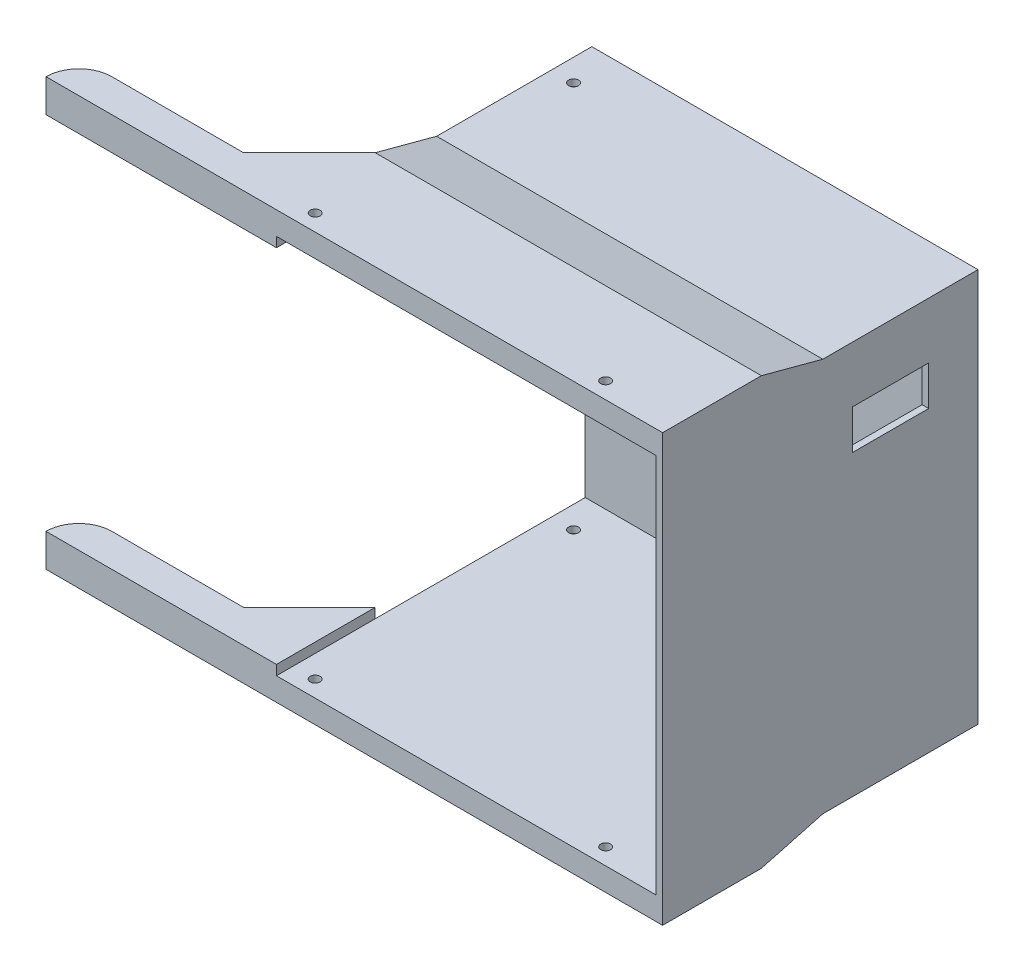
ISO-10303-21;
HEADER;
FILE_DESCRIPTION(('STEP AP214'),'2;1');
FILE_NAME('part.step','',(''),(''),'','','');
FILE_SCHEMA(('AUTOMOTIVE_DESIGN { 1 0 10303 214 1 1 1 1 }'));
ENDSEC;
DATA;
#1=APPLICATION_CONTEXT('core data for automotive mechanical design processes');
#2=APPLICATION_PROTOCOL_DEFINITION('international standard','automotive_design',2000,#1);
#3=PRODUCT_CONTEXT('',#1,'mechanical');
#4=PRODUCT('Part','Part','',(#3));
#5=PRODUCT_RELATED_PRODUCT_CATEGORY('part','',(#4));
#6=PRODUCT_DEFINITION_FORMATION('','',#4);
#7=PRODUCT_DEFINITION_CONTEXT('part definition',#1,'design');
#8=PRODUCT_DEFINITION('design','',#6,#7);
#9=PRODUCT_DEFINITION_SHAPE('','',#8);
#10=(LENGTH_UNIT() NAMED_UNIT(*) SI_UNIT(.MILLI.,.METRE.));
#11=(NAMED_UNIT(*) PLANE_ANGLE_UNIT() SI_UNIT($,.RADIAN.));
#12=(NAMED_UNIT(*) SI_UNIT($,.STERADIAN.) SOLID_ANGLE_UNIT());
#13=UNCERTAINTY_MEASURE_WITH_UNIT(LENGTH_MEASURE(1.E-05),#10,'distance_accuracy_value','');
#14=(GEOMETRIC_REPRESENTATION_CONTEXT(3) GLOBAL_UNCERTAINTY_ASSIGNED_CONTEXT((#13)) GLOBAL_UNIT_ASSIGNED_CONTEXT((#10,
#11,#12)) REPRESENTATION_CONTEXT('',''));
#15=CARTESIAN_POINT('',(0.,0.,0.));
#16=DIRECTION('',(0.,0.,1.));
#17=DIRECTION('',(1.,0.,0.));
#18=AXIS2_PLACEMENT_3D('',#15,#16,#17);
#19=CARTESIAN_POINT('',(-40.,57.8,-261.621491158597));
#20=DIRECTION('',(-1.,0.,0.));
#21=DIRECTION('',(0.,0.,1.));
#22=AXIS2_PLACEMENT_3D('',#19,#20,#21);
#23=PLANE('',#22);
#24=DIRECTION('',(0.,-0.258819045102515,-0.96592582628907));
#25=VECTOR('',#24,1.);
#26=CARTESIAN_POINT('',(-40.,64.8,-30.));
#27=LINE('',#26,#25);
#28=CARTESIAN_POINT('',(-40.,64.8,-30.0000000000001));
#29=VERTEX_POINT('',#28);
#30=CARTESIAN_POINT('',(-40.,59.8,-48.6602540378449));
#31=VERTEX_POINT('',#30);
#32=EDGE_CURVE('E390',#29,#31,#27,.T.);
#33=ORIENTED_EDGE('',*,*,#32,.T.);
#34=DIRECTION('',(0.,0.,1.));
#35=VECTOR('',#34,1.);
#36=CARTESIAN_POINT('',(-40.,59.8,-261.621491158597));
#37=LINE('',#36,#35);
#38=CARTESIAN_POINT('',(-40.,59.8,-95.8));
#39=VERTEX_POINT('',#38);
#40=EDGE_CURVE('E372',#39,#31,#37,.T.);
#41=ORIENTED_EDGE('',*,*,#40,.F.);
#42=DIRECTION('',(0.,1.,0.));
#43=VECTOR('',#42,1.);
#44=CARTESIAN_POINT('',(-40.,59.8,-95.8));
#45=LINE('',#44,#43);
#46=CARTESIAN_POINT('',(-40.,-59.8,-95.8));
#47=VERTEX_POINT('',#46);
#48=EDGE_CURVE('E325',#47,#39,#45,.T.);
#49=ORIENTED_EDGE('',*,*,#48,.F.);
#50=DIRECTION('',(0.,0.,1.));
#51=VECTOR('',#50,1.);
#52=CARTESIAN_POINT('',(-40.,-59.8,-261.621491158597));
#53=LINE('',#52,#51);
#54=CARTESIAN_POINT('',(-40.,-59.8,-48.6602540378449));
#55=VERTEX_POINT('',#54);
#56=EDGE_CURVE('E366',#47,#55,#53,.T.);
#57=ORIENTED_EDGE('',*,*,#56,.T.);
#58=DIRECTION('',(0.,0.258819045102515,-0.96592582628907));
#59=VECTOR('',#58,1.);
#60=CARTESIAN_POINT('',(-40.,-64.8,-30.));
#61=LINE('',#60,#59);
#62=CARTESIAN_POINT('',(-40.,-64.8,-30.0000000000001));
#63=VERTEX_POINT('',#62);
#64=EDGE_CURVE('E268',#63,#55,#61,.T.);
#65=ORIENTED_EDGE('',*,*,#64,.F.);
#66=DIRECTION('',(0.,-1.,0.));
#67=VECTOR('',#66,1.);
#68=CARTESIAN_POINT('',(-40.,-64.8,-30.0000000000001));
#69=LINE('',#68,#67);
#70=CARTESIAN_POINT('',(-40.,-57.8,-30.0000000000001));
#71=VERTEX_POINT('',#70);
#72=EDGE_CURVE('E259',#71,#63,#69,.T.);
#73=ORIENTED_EDGE('',*,*,#72,.F.);
#74=DIRECTION('',(0.,0.,1.));
#75=VECTOR('',#74,1.);
#76=CARTESIAN_POINT('',(-40.,-57.8,-261.621491158597));
#77=LINE('',#76,#75);
#78=CARTESIAN_POINT('',(-40.,-57.8,-93.8));
#79=VERTEX_POINT('',#78);
#80=EDGE_CURVE('E354',#79,#71,#77,.T.);
#81=ORIENTED_EDGE('',*,*,#80,.F.);
#82=DIRECTION('',(0.,1.,0.));
#83=VECTOR('',#82,1.);
#84=CARTESIAN_POINT('',(-40.,59.8,-93.8));
#85=LINE('',#84,#83);
#86=CARTESIAN_POINT('',(-40.,57.8,-93.8));
#87=VERTEX_POINT('',#86);
#88=EDGE_CURVE('E322',#79,#87,#85,.T.);
#89=ORIENTED_EDGE('',*,*,#88,.T.);
#90=DIRECTION('',(0.,0.,1.));
#91=VECTOR('',#90,1.);
#92=CARTESIAN_POINT('',(-40.,57.8,-261.621491158597));
#93=LINE('',#92,#91);
#94=CARTESIAN_POINT('',(-40.,57.8,-30.0000000000001));
#95=VERTEX_POINT('',#94);
#96=EDGE_CURVE('E363',#87,#95,#93,.T.);
#97=ORIENTED_EDGE('',*,*,#96,.T.);
#98=DIRECTION('',(0.,1.,0.));
#99=VECTOR('',#98,1.);
#100=CARTESIAN_POINT('',(-40.,64.8,-30.0000000000001));
#101=LINE('',#100,#99);
#102=EDGE_CURVE('E382',#95,#29,#101,.T.);
#103=ORIENTED_EDGE('',*,*,#102,.T.);
#104=EDGE_LOOP('',(#33,#41,#49,#57,#65,#73,#81,#89,#97,#103));
#105=FACE_BOUND('',#104,.T.);
#106=ADVANCED_FACE('F37',(#105),#23,.T.);
#107=CARTESIAN_POINT('',(-40.,-59.8,-261.621491158597));
#108=DIRECTION('',(0.,-1.,0.));
#109=DIRECTION('',(1.,0.,0.));
#110=AXIS2_PLACEMENT_3D('',#107,#108,#109);
#111=PLANE('',#110);
#112=CARTESIAN_POINT('',(-33.25,-59.8,-83.5));
#113=DIRECTION('',(0.,-1.,0.));
#114=DIRECTION('',(1.,0.,0.));
#115=AXIS2_PLACEMENT_3D('',#112,#113,#114);
#116=CIRCLE('',#115,1.5);
#117=CARTESIAN_POINT('',(-31.75,-59.8,-83.5));
#118=VERTEX_POINT('',#117);
#119=EDGE_CURVE('E413',#118,#118,#116,.T.);
#120=ORIENTED_EDGE('',*,*,#119,.F.);
#121=EDGE_LOOP('',(#120));
#122=FACE_BOUND('',#121,.T.);
#123=DIRECTION('',(0.,0.,1.));
#124=VECTOR('',#123,1.);
#125=CARTESIAN_POINT('',(77.3,-59.8,-261.621491158597));
#126=LINE('',#125,#124);
#127=CARTESIAN_POINT('',(77.3,-59.8,-95.8));
#128=VERTEX_POINT('',#127);
#129=CARTESIAN_POINT('',(77.3,-59.8,-48.6602540378449));
#130=VERTEX_POINT('',#129);
#131=EDGE_CURVE('E343',#128,#130,#126,.T.);
#132=ORIENTED_EDGE('',*,*,#131,.T.);
#133=DIRECTION('',(1.,0.,0.));
#134=VECTOR('',#133,1.);
#135=CARTESIAN_POINT('',(77.3,-59.8,-48.6602540378449));
#136=LINE('',#135,#134);
#137=EDGE_CURVE('E266',#55,#130,#136,.T.);
#138=ORIENTED_EDGE('',*,*,#137,.F.);
#139=ORIENTED_EDGE('',*,*,#56,.F.);
#140=DIRECTION('',(-1.,0.,0.));
#141=VECTOR('',#140,1.);
#142=CARTESIAN_POINT('',(-40.,-59.8,-95.8));
#143=LINE('',#142,#141);
#144=EDGE_CURVE('E334',#128,#47,#143,.T.);
#145=ORIENTED_EDGE('',*,*,#144,.F.);
#146=EDGE_LOOP('',(#132,#138,#139,#145));
#147=FACE_BOUND('',#146,.T.);
#148=ADVANCED_FACE('F499',(#122,#147),#111,.T.);
#149=CARTESIAN_POINT('',(75.3,57.8,-261.621491158597));
#150=DIRECTION('',(0.,-1.,0.));
#151=DIRECTION('',(0.,0.,-1.));
#152=AXIS2_PLACEMENT_3D('',#149,#150,#151);
#153=PLANE('',#152);
#154=CARTESIAN_POINT('',(55.,57.8,-4.99999999999998));
#155=DIRECTION('',(0.,-1.,0.));
#156=DIRECTION('',(0.,0.,-1.));
#157=AXIS2_PLACEMENT_3D('',#154,#155,#156);
#158=CIRCLE('',#157,1.5);
#159=CARTESIAN_POINT('',(55.,57.8,-6.49999999999999));
#160=VERTEX_POINT('',#159);
#161=EDGE_CURVE('E423',#160,#160,#158,.T.);
#162=ORIENTED_EDGE('',*,*,#161,.F.);
#163=EDGE_LOOP('',(#162));
#164=FACE_BOUND('',#163,.T.);
#165=CARTESIAN_POINT('',(-33.25,57.8,-4.99999999999997));
#166=DIRECTION('',(0.,-1.,0.));
#167=DIRECTION('',(0.,0.,-1.));
#168=AXIS2_PLACEMENT_3D('',#165,#166,#167);
#169=CIRCLE('',#168,1.5);
#170=CARTESIAN_POINT('',(-33.25,57.8,-6.49999999999998));
#171=VERTEX_POINT('',#170);
#172=EDGE_CURVE('E429',#171,#171,#169,.T.);
#173=ORIENTED_EDGE('',*,*,#172,.F.);
#174=EDGE_LOOP('',(#173));
#175=FACE_BOUND('',#174,.T.);
#176=CARTESIAN_POINT('',(-33.25,57.8,-83.5));
#177=DIRECTION('',(0.,-1.,0.));
#178=DIRECTION('',(0.,0.,-1.));
#179=AXIS2_PLACEMENT_3D('',#176,#177,#178);
#180=CIRCLE('',#179,1.5);
#181=CARTESIAN_POINT('',(-33.25,57.8,-85.));
#182=VERTEX_POINT('',#181);
#183=EDGE_CURVE('E415',#182,#182,#180,.T.);
#184=ORIENTED_EDGE('',*,*,#183,.F.);
#185=EDGE_LOOP('',(#184));
#186=FACE_BOUND('',#185,.T.);
#187=CARTESIAN_POINT('',(-40.,57.8,0.));
#188=VERTEX_POINT('',#187);
#189=EDGE_CURVE('E371',#95,#188,#93,.T.);
#190=ORIENTED_EDGE('',*,*,#189,.F.);
#191=ORIENTED_EDGE('',*,*,#96,.F.);
#192=DIRECTION('',(1.,0.,0.));
#193=VECTOR('',#192,1.);
#194=CARTESIAN_POINT('',(75.3,57.8,-93.8));
#195=LINE('',#194,#193);
#196=CARTESIAN_POINT('',(75.3,57.8,-93.8));
#197=VERTEX_POINT('',#196);
#198=EDGE_CURVE('E360',#87,#197,#195,.T.);
#199=ORIENTED_EDGE('',*,*,#198,.T.);
#200=DIRECTION('',(0.,0.,1.));
#201=VECTOR('',#200,1.);
#202=CARTESIAN_POINT('',(75.3,57.8,-261.621491158597));
#203=LINE('',#202,#201);
#204=CARTESIAN_POINT('',(75.3,57.8,0.));
#205=VERTEX_POINT('',#204);
#206=EDGE_CURVE('E359',#197,#205,#203,.T.);
#207=ORIENTED_EDGE('',*,*,#206,.T.);
#208=DIRECTION('',(1.,0.,0.));
#209=VECTOR('',#208,1.);
#210=CARTESIAN_POINT('',(75.3,57.8,0.));
#211=LINE('',#210,#209);
#212=EDGE_CURVE('E347',#188,#205,#211,.T.);
#213=ORIENTED_EDGE('',*,*,#212,.F.);
#214=EDGE_LOOP('',(#190,#191,#199,#207,#213));
#215=FACE_BOUND('',#214,.T.);
#216=ADVANCED_FACE('F532',(#164,#175,#186,#215),#153,.T.);
#217=CARTESIAN_POINT('',(-40.,54.8,-10.));
#218=DIRECTION('',(0.,0.,-1.));
#219=DIRECTION('',(-1.,0.,0.));
#220=AXIS2_PLACEMENT_3D('',#217,#218,#219);
#221=PLANE('',#220);
#222=DIRECTION('',(-1.,0.,0.));
#223=VECTOR('',#222,1.);
#224=CARTESIAN_POINT('',(-40.,54.8,-10.));
#225=LINE('',#224,#223);
#226=CARTESIAN_POINT('',(-59.9999999999999,54.8,-10.));
#227=VERTEX_POINT('',#226);
#228=CARTESIAN_POINT('',(-100.,54.8,-9.99999999999999));
#229=VERTEX_POINT('',#228);
#230=EDGE_CURVE('E300',#227,#229,#225,.T.);
#231=ORIENTED_EDGE('',*,*,#230,.T.);
#232=DIRECTION('',(0.,1.,0.));
#233=VECTOR('',#232,1.);
#234=CARTESIAN_POINT('',(-100.,54.8,-9.99999999999999));
#235=LINE('',#234,#233);
#236=CARTESIAN_POINT('',(-100.,64.8,-9.99999999999999));
#237=VERTEX_POINT('',#236);
#238=EDGE_CURVE('E394',#229,#237,#235,.T.);
#239=ORIENTED_EDGE('',*,*,#238,.T.);
#240=DIRECTION('',(-1.,0.,0.));
#241=VECTOR('',#240,1.);
#242=CARTESIAN_POINT('',(-110.,64.8,-9.99999999999999));
#243=LINE('',#242,#241);
#244=CARTESIAN_POINT('',(-59.9999999999999,64.8,-10.));
#245=VERTEX_POINT('',#244);
#246=EDGE_CURVE('E295',#245,#237,#243,.T.);
#247=ORIENTED_EDGE('',*,*,#246,.F.);
#248=DIRECTION('',(0.,-1.,0.));
#249=VECTOR('',#248,1.);
#250=CARTESIAN_POINT('',(-59.9999999999999,57.8,-10.));
#251=LINE('',#250,#249);
#252=EDGE_CURVE('E384',#245,#227,#251,.T.);
#253=ORIENTED_EDGE('',*,*,#252,.T.);
#254=EDGE_LOOP('',(#231,#239,#247,#253));
#255=FACE_BOUND('',#254,.T.);
#256=ADVANCED_FACE('F463',(#255),#221,.T.);
#257=CARTESIAN_POINT('',(0.,0.,0.));
#258=DIRECTION('',(0.,0.,-1.));
#259=DIRECTION('',(-1.,0.,0.));
#260=AXIS2_PLACEMENT_3D('',#257,#258,#259);
#261=PLANE('',#260);
#262=DIRECTION('',(0.,1.,0.));
#263=VECTOR('',#262,1.);
#264=CARTESIAN_POINT('',(-40.,54.8,0.));
#265=LINE('',#264,#263);
#266=CARTESIAN_POINT('',(-40.,54.8,0.));
#267=VERTEX_POINT('',#266);
#268=EDGE_CURVE('E307',#267,#188,#265,.T.);
#269=ORIENTED_EDGE('',*,*,#268,.T.);
#270=ORIENTED_EDGE('',*,*,#212,.T.);
#271=DIRECTION('',(0.,-1.,0.));
#272=VECTOR('',#271,1.);
#273=CARTESIAN_POINT('',(75.3,-57.8,0.));
#274=LINE('',#273,#272);
#275=CARTESIAN_POINT('',(75.3,-57.8,0.));
#276=VERTEX_POINT('',#275);
#277=EDGE_CURVE('E344',#205,#276,#274,.T.);
#278=ORIENTED_EDGE('',*,*,#277,.T.);
#279=DIRECTION('',(-1.,0.,0.));
#280=VECTOR('',#279,1.);
#281=CARTESIAN_POINT('',(-40.,-57.8,0.));
#282=LINE('',#281,#280);
#283=CARTESIAN_POINT('',(-40.,-57.8,0.));
#284=VERTEX_POINT('',#283);
#285=EDGE_CURVE('E340',#276,#284,#282,.T.);
#286=ORIENTED_EDGE('',*,*,#285,.T.);
#287=DIRECTION('',(0.,-1.,0.));
#288=VECTOR('',#287,1.);
#289=CARTESIAN_POINT('',(-40.,-54.8,0.));
#290=LINE('',#289,#288);
#291=CARTESIAN_POINT('',(-40.,-54.8,0.));
#292=VERTEX_POINT('',#291);
#293=EDGE_CURVE('E252',#292,#284,#290,.T.);
#294=ORIENTED_EDGE('',*,*,#293,.F.);
#295=DIRECTION('',(1.,0.,0.));
#296=VECTOR('',#295,1.);
#297=CARTESIAN_POINT('',(-40.,-54.8,0.));
#298=LINE('',#297,#296);
#299=CARTESIAN_POINT('',(-110.,-54.8,0.));
#300=VERTEX_POINT('',#299);
#301=EDGE_CURVE('E248',#300,#292,#298,.T.);
#302=ORIENTED_EDGE('',*,*,#301,.F.);
#303=DIRECTION('',(0.,-1.,0.));
#304=VECTOR('',#303,1.);
#305=CARTESIAN_POINT('',(-110.,-54.8,0.));
#306=LINE('',#305,#304);
#307=CARTESIAN_POINT('',(-110.,-64.8,0.));
#308=VERTEX_POINT('',#307);
#309=EDGE_CURVE('E251',#300,#308,#306,.T.);
#310=ORIENTED_EDGE('',*,*,#309,.T.);
#311=DIRECTION('',(1.,0.,0.));
#312=VECTOR('',#311,1.);
#313=CARTESIAN_POINT('',(0.,-64.8,0.));
#314=LINE('',#313,#312);
#315=CARTESIAN_POINT('',(77.3,-64.8,0.));
#316=VERTEX_POINT('',#315);
#317=EDGE_CURVE('E230',#308,#316,#314,.T.);
#318=ORIENTED_EDGE('',*,*,#317,.T.);
#319=DIRECTION('',(0.,1.,0.));
#320=VECTOR('',#319,1.);
#321=CARTESIAN_POINT('',(77.3,-59.8,0.));
#322=LINE('',#321,#320);
#323=CARTESIAN_POINT('',(77.3,64.8,0.));
#324=VERTEX_POINT('',#323);
#325=EDGE_CURVE('E337',#316,#324,#322,.T.);
#326=ORIENTED_EDGE('',*,*,#325,.T.);
#327=DIRECTION('',(1.,0.,0.));
#328=VECTOR('',#327,1.);
#329=CARTESIAN_POINT('',(0.,64.8,0.));
#330=LINE('',#329,#328);
#331=CARTESIAN_POINT('',(-110.,64.8,0.));
#332=VERTEX_POINT('',#331);
#333=EDGE_CURVE('E286',#332,#324,#330,.T.);
#334=ORIENTED_EDGE('',*,*,#333,.F.);
#335=DIRECTION('',(0.,1.,0.));
#336=VECTOR('',#335,1.);
#337=CARTESIAN_POINT('',(-110.,54.8,0.));
#338=LINE('',#337,#336);
#339=CARTESIAN_POINT('',(-110.,54.8,0.));
#340=VERTEX_POINT('',#339);
#341=EDGE_CURVE('E306',#340,#332,#338,.T.);
#342=ORIENTED_EDGE('',*,*,#341,.F.);
#343=DIRECTION('',(1.,0.,0.));
#344=VECTOR('',#343,1.);
#345=CARTESIAN_POINT('',(-40.,54.8,0.));
#346=LINE('',#345,#344);
#347=EDGE_CURVE('E303',#340,#267,#346,.T.);
#348=ORIENTED_EDGE('',*,*,#347,.T.);
#349=EDGE_LOOP('',(#269,#270,#278,#286,#294,#302,#310,#318,#326,#334,#342,#348));
#350=FACE_BOUND('',#349,.T.);
#351=ADVANCED_FACE('F476',(#350),#261,.F.);
#352=CARTESIAN_POINT('',(77.3,-59.8,-261.621491158597));
#353=DIRECTION('',(1.,0.,0.));
#354=DIRECTION('',(0.,0.,-1.));
#355=AXIS2_PLACEMENT_3D('',#352,#353,#354);
#356=PLANE('',#355);
#357=DIRECTION('',(0.,1.,0.));
#358=VECTOR('',#357,1.);
#359=CARTESIAN_POINT('',(77.3,42.75,-80.8220631132078));
#360=LINE('',#359,#358);
#361=CARTESIAN_POINT('',(77.3,30.75,-80.8220631132078));
#362=VERTEX_POINT('',#361);
#363=CARTESIAN_POINT('',(77.3,42.75,-80.8220631132078));
#364=VERTEX_POINT('',#363);
#365=EDGE_CURVE('E53',#362,#364,#360,.T.);
#366=ORIENTED_EDGE('',*,*,#365,.F.);
#367=DIRECTION('',(0.,0.,-1.));
#368=VECTOR('',#367,1.);
#369=CARTESIAN_POINT('',(77.3,30.75,-57.6779368867928));
#370=LINE('',#369,#368);
#371=CARTESIAN_POINT('',(77.3,30.75,-57.6779368867928));
#372=VERTEX_POINT('',#371);
#373=EDGE_CURVE('E217',#372,#362,#370,.T.);
#374=ORIENTED_EDGE('',*,*,#373,.F.);
#375=DIRECTION('',(0.,-1.,0.));
#376=VECTOR('',#375,1.);
#377=CARTESIAN_POINT('',(77.3,42.75,-57.6779368867928));
#378=LINE('',#377,#376);
#379=CARTESIAN_POINT('',(77.3,42.75,-57.6779368867928));
#380=VERTEX_POINT('',#379);
#381=EDGE_CURVE('E201',#380,#372,#378,.T.);
#382=ORIENTED_EDGE('',*,*,#381,.F.);
#383=DIRECTION('',(0.,0.,1.));
#384=VECTOR('',#383,1.);
#385=CARTESIAN_POINT('',(77.3,42.75,-57.6779368867928));
#386=LINE('',#385,#384);
#387=EDGE_CURVE('E210',#364,#380,#386,.T.);
#388=ORIENTED_EDGE('',*,*,#387,.F.);
#389=EDGE_LOOP('',(#366,#374,#382,#388));
#390=FACE_BOUND('',#389,.T.);
#391=DIRECTION('',(0.,0.,-1.));
#392=VECTOR('',#391,1.);
#393=CARTESIAN_POINT('',(77.3,64.8,0.));
#394=LINE('',#393,#392);
#395=CARTESIAN_POINT('',(77.3,64.8,-30.));
#396=VERTEX_POINT('',#395);
#397=EDGE_CURVE('E289',#324,#396,#394,.T.);
#398=ORIENTED_EDGE('',*,*,#397,.F.);
#399=ORIENTED_EDGE('',*,*,#325,.F.);
#400=DIRECTION('',(0.,0.,-1.));
#401=VECTOR('',#400,1.);
#402=CARTESIAN_POINT('',(77.3,-64.8,0.));
#403=LINE('',#402,#401);
#404=CARTESIAN_POINT('',(77.3,-64.8,-30.));
#405=VERTEX_POINT('',#404);
#406=EDGE_CURVE('E233',#316,#405,#403,.T.);
#407=ORIENTED_EDGE('',*,*,#406,.T.);
#408=DIRECTION('',(0.,-0.258819045102515,0.96592582628907));
#409=VECTOR('',#408,1.);
#410=CARTESIAN_POINT('',(77.3,-64.8,-30.));
#411=LINE('',#410,#409);
#412=EDGE_CURVE('E270',#130,#405,#411,.T.);
#413=ORIENTED_EDGE('',*,*,#412,.F.);
#414=ORIENTED_EDGE('',*,*,#131,.F.);
#415=DIRECTION('',(0.,-1.,0.));
#416=VECTOR('',#415,1.);
#417=CARTESIAN_POINT('',(77.3,59.8,-95.8));
#418=LINE('',#417,#416);
#419=CARTESIAN_POINT('',(77.3,59.8,-95.8));
#420=VERTEX_POINT('',#419);
#421=EDGE_CURVE('E331',#420,#128,#418,.T.);
#422=ORIENTED_EDGE('',*,*,#421,.F.);
#423=DIRECTION('',(0.,0.,1.));
#424=VECTOR('',#423,1.);
#425=CARTESIAN_POINT('',(77.3,59.8,-261.621491158597));
#426=LINE('',#425,#424);
#427=CARTESIAN_POINT('',(77.3,59.8,-48.6602540378449));
#428=VERTEX_POINT('',#427);
#429=EDGE_CURVE('E375',#420,#428,#426,.T.);
#430=ORIENTED_EDGE('',*,*,#429,.T.);
#431=DIRECTION('',(0.,0.258819045102515,0.96592582628907));
#432=VECTOR('',#431,1.);
#433=CARTESIAN_POINT('',(77.3,64.8,-30.));
#434=LINE('',#433,#432);
#435=EDGE_CURVE('E392',#428,#396,#434,.T.);
#436=ORIENTED_EDGE('',*,*,#435,.T.);
#437=EDGE_LOOP('',(#398,#399,#407,#413,#414,#422,#430,#436));
#438=FACE_BOUND('',#437,.T.);
#439=ADVANCED_FACE('F214',(#390,#438),#356,.T.);
#440=CARTESIAN_POINT('',(77.3,59.8,-261.621491158597));
#441=DIRECTION('',(0.,1.,0.));
#442=DIRECTION('',(-1.,0.,0.));
#443=AXIS2_PLACEMENT_3D('',#440,#441,#442);
#444=PLANE('',#443);
#445=CARTESIAN_POINT('',(-33.25,59.8,-83.5));
#446=DIRECTION('',(0.,1.,0.));
#447=DIRECTION('',(-1.,0.,0.));
#448=AXIS2_PLACEMENT_3D('',#445,#446,#447);
#449=CIRCLE('',#448,1.5);
#450=CARTESIAN_POINT('',(-34.75,59.8,-83.5));
#451=VERTEX_POINT('',#450);
#452=EDGE_CURVE('E420',#451,#451,#449,.T.);
#453=ORIENTED_EDGE('',*,*,#452,.F.);
#454=EDGE_LOOP('',(#453));
#455=FACE_BOUND('',#454,.T.);
#456=ORIENTED_EDGE('',*,*,#40,.T.);
#457=DIRECTION('',(1.,0.,0.));
#458=VECTOR('',#457,1.);
#459=CARTESIAN_POINT('',(77.3,59.8,-48.6602540378449));
#460=LINE('',#459,#458);
#461=EDGE_CURVE('E388',#31,#428,#460,.T.);
#462=ORIENTED_EDGE('',*,*,#461,.T.);
#463=ORIENTED_EDGE('',*,*,#429,.F.);
#464=DIRECTION('',(1.,0.,0.));
#465=VECTOR('',#464,1.);
#466=CARTESIAN_POINT('',(-40.,59.8,-95.8));
#467=LINE('',#466,#465);
#468=EDGE_CURVE('E328',#39,#420,#467,.T.);
#469=ORIENTED_EDGE('',*,*,#468,.F.);
#470=EDGE_LOOP('',(#456,#462,#463,#469));
#471=FACE_BOUND('',#470,.T.);
#472=ADVANCED_FACE('F490',(#455,#471),#444,.T.);
#473=CARTESIAN_POINT('',(75.3,-57.8,-261.621491158597));
#474=DIRECTION('',(-1.,0.,0.));
#475=DIRECTION('',(0.,0.,1.));
#476=AXIS2_PLACEMENT_3D('',#473,#474,#475);
#477=PLANE('',#476);
#478=DIRECTION('',(0.,-1.,0.));
#479=VECTOR('',#478,1.);
#480=CARTESIAN_POINT('',(75.3,-57.8,-80.8220631132078));
#481=LINE('',#480,#479);
#482=CARTESIAN_POINT('',(75.3,42.75,-80.8220631132078));
#483=VERTEX_POINT('',#482);
#484=CARTESIAN_POINT('',(75.3,30.75,-80.8220631132078));
#485=VERTEX_POINT('',#484);
#486=EDGE_CURVE('E11',#483,#485,#481,.T.);
#487=ORIENTED_EDGE('',*,*,#486,.F.);
#488=DIRECTION('',(0.,0.,-1.));
#489=VECTOR('',#488,1.);
#490=CARTESIAN_POINT('',(75.3,42.75,-261.621491158597));
#491=LINE('',#490,#489);
#492=CARTESIAN_POINT('',(75.3,42.75,-57.6779368867928));
#493=VERTEX_POINT('',#492);
#494=EDGE_CURVE('E401',#493,#483,#491,.T.);
#495=ORIENTED_EDGE('',*,*,#494,.F.);
#496=DIRECTION('',(0.,1.,0.));
#497=VECTOR('',#496,1.);
#498=CARTESIAN_POINT('',(75.3,-57.8,-57.6779368867927));
#499=LINE('',#498,#497);
#500=CARTESIAN_POINT('',(75.3,30.75,-57.6779368867928));
#501=VERTEX_POINT('',#500);
#502=EDGE_CURVE('E204',#501,#493,#499,.T.);
#503=ORIENTED_EDGE('',*,*,#502,.F.);
#504=DIRECTION('',(0.,0.,1.));
#505=VECTOR('',#504,1.);
#506=CARTESIAN_POINT('',(75.3,30.75,-261.621491158597));
#507=LINE('',#506,#505);
#508=EDGE_CURVE('E46',#485,#501,#507,.T.);
#509=ORIENTED_EDGE('',*,*,#508,.F.);
#510=EDGE_LOOP('',(#487,#495,#503,#509));
#511=FACE_BOUND('',#510,.T.);
#512=ORIENTED_EDGE('',*,*,#206,.F.);
#513=DIRECTION('',(0.,-1.,0.));
#514=VECTOR('',#513,1.);
#515=CARTESIAN_POINT('',(75.3,-57.8,-93.8));
#516=LINE('',#515,#514);
#517=CARTESIAN_POINT('',(75.3,-57.8,-93.8));
#518=VERTEX_POINT('',#517);
#519=EDGE_CURVE('E356',#197,#518,#516,.T.);
#520=ORIENTED_EDGE('',*,*,#519,.T.);
#521=DIRECTION('',(0.,0.,1.));
#522=VECTOR('',#521,1.);
#523=CARTESIAN_POINT('',(75.3,-57.8,-261.621491158597));
#524=LINE('',#523,#522);
#525=EDGE_CURVE('E355',#518,#276,#524,.T.);
#526=ORIENTED_EDGE('',*,*,#525,.T.);
#527=ORIENTED_EDGE('',*,*,#277,.F.);
#528=EDGE_LOOP('',(#512,#520,#526,#527));
#529=FACE_BOUND('',#528,.T.);
#530=ADVANCED_FACE('F410',(#511,#529),#477,.T.);
#531=CARTESIAN_POINT('',(-40.,-57.8,-261.621491158597));
#532=DIRECTION('',(0.,1.,0.));
#533=DIRECTION('',(0.,0.,1.));
#534=AXIS2_PLACEMENT_3D('',#531,#532,#533);
#535=PLANE('',#534);
#536=CARTESIAN_POINT('',(55.,-57.8,-4.99999999999998));
#537=DIRECTION('',(0.,1.,0.));
#538=DIRECTION('',(0.,0.,1.));
#539=AXIS2_PLACEMENT_3D('',#536,#537,#538);
#540=CIRCLE('',#539,1.5);
#541=CARTESIAN_POINT('',(55.,-57.8,-3.49999999999998));
#542=VERTEX_POINT('',#541);
#543=EDGE_CURVE('E426',#542,#542,#540,.T.);
#544=ORIENTED_EDGE('',*,*,#543,.F.);
#545=EDGE_LOOP('',(#544));
#546=FACE_BOUND('',#545,.T.);
#547=CARTESIAN_POINT('',(-33.25,-57.8,-4.99999999999997));
#548=DIRECTION('',(0.,1.,0.));
#549=DIRECTION('',(0.,0.,1.));
#550=AXIS2_PLACEMENT_3D('',#547,#548,#549);
#551=CIRCLE('',#550,1.5);
#552=CARTESIAN_POINT('',(-33.25,-57.8,-3.49999999999997));
#553=VERTEX_POINT('',#552);
#554=EDGE_CURVE('E432',#553,#553,#551,.T.);
#555=ORIENTED_EDGE('',*,*,#554,.F.);
#556=EDGE_LOOP('',(#555));
#557=FACE_BOUND('',#556,.T.);
#558=CARTESIAN_POINT('',(-33.25,-57.8,-83.5));
#559=DIRECTION('',(0.,1.,0.));
#560=DIRECTION('',(0.,0.,1.));
#561=AXIS2_PLACEMENT_3D('',#558,#559,#560);
#562=CIRCLE('',#561,1.5);
#563=CARTESIAN_POINT('',(-33.25,-57.8,-82.));
#564=VERTEX_POINT('',#563);
#565=EDGE_CURVE('E41',#564,#564,#562,.T.);
#566=ORIENTED_EDGE('',*,*,#565,.F.);
#567=EDGE_LOOP('',(#566));
#568=FACE_BOUND('',#567,.T.);
#569=ORIENTED_EDGE('',*,*,#525,.F.);
#570=DIRECTION('',(-1.,0.,0.));
#571=VECTOR('',#570,1.);
#572=CARTESIAN_POINT('',(-40.,-57.8,-93.8));
#573=LINE('',#572,#571);
#574=EDGE_CURVE('E351',#518,#79,#573,.T.);
#575=ORIENTED_EDGE('',*,*,#574,.T.);
#576=ORIENTED_EDGE('',*,*,#80,.T.);
#577=DIRECTION('',(0.,0.,1.));
#578=VECTOR('',#577,1.);
#579=CARTESIAN_POINT('',(-40.,-57.8,-261.621491158597));
#580=LINE('',#579,#578);
#581=EDGE_CURVE('E254',#71,#284,#580,.T.);
#582=ORIENTED_EDGE('',*,*,#581,.T.);
#583=ORIENTED_EDGE('',*,*,#285,.F.);
#584=EDGE_LOOP('',(#569,#575,#576,#582,#583));
#585=FACE_BOUND('',#584,.T.);
#586=ADVANCED_FACE('F525',(#546,#557,#568,#585),#535,.T.);
#587=CARTESIAN_POINT('',(0.,0.,-93.8));
#588=DIRECTION('',(0.,0.,1.));
#589=DIRECTION('',(0.,-1.,0.));
#590=AXIS2_PLACEMENT_3D('',#587,#588,#589);
#591=PLANE('',#590);
#592=CARTESIAN_POINT('',(-33.25,19.1666666666666,-93.8));
#593=DIRECTION('',(0.,0.,-1.));
#594=DIRECTION('',(0.,1.,0.));
#595=AXIS2_PLACEMENT_3D('',#592,#593,#594);
#596=CIRCLE('',#595,1.5);
#597=CARTESIAN_POINT('',(-33.25,20.6666666666666,-93.8));
#598=VERTEX_POINT('',#597);
#599=EDGE_CURVE('E310',#598,#598,#596,.T.);
#600=ORIENTED_EDGE('',*,*,#599,.T.);
#601=EDGE_LOOP('',(#600));
#602=FACE_BOUND('',#601,.T.);
#603=CARTESIAN_POINT('',(-33.25,-19.1666666666667,-93.8));
#604=DIRECTION('',(0.,0.,-1.));
#605=DIRECTION('',(0.,1.,0.));
#606=AXIS2_PLACEMENT_3D('',#603,#604,#605);
#607=CIRCLE('',#606,1.5);
#608=CARTESIAN_POINT('',(-33.25,-17.6666666666667,-93.8));
#609=VERTEX_POINT('',#608);
#610=EDGE_CURVE('E316',#609,#609,#607,.T.);
#611=ORIENTED_EDGE('',*,*,#610,.T.);
#612=EDGE_LOOP('',(#611));
#613=FACE_BOUND('',#612,.T.);
#614=ORIENTED_EDGE('',*,*,#574,.F.);
#615=ORIENTED_EDGE('',*,*,#519,.F.);
#616=ORIENTED_EDGE('',*,*,#198,.F.);
#617=ORIENTED_EDGE('',*,*,#88,.F.);
#618=EDGE_LOOP('',(#614,#615,#616,#617));
#619=FACE_BOUND('',#618,.T.);
#620=ADVANCED_FACE('F528',(#602,#613,#619),#591,.T.);
#621=CARTESIAN_POINT('',(0.,0.,-95.8));
#622=DIRECTION('',(0.,0.,1.));
#623=DIRECTION('',(0.,-1.,0.));
#624=AXIS2_PLACEMENT_3D('',#621,#622,#623);
#625=PLANE('',#624);
#626=ORIENTED_EDGE('',*,*,#48,.T.);
#627=ORIENTED_EDGE('',*,*,#468,.T.);
#628=ORIENTED_EDGE('',*,*,#421,.T.);
#629=ORIENTED_EDGE('',*,*,#144,.T.);
#630=EDGE_LOOP('',(#626,#627,#628,#629));
#631=FACE_BOUND('',#630,.T.);
#632=CARTESIAN_POINT('',(-33.25,-19.1666666666667,-95.8));
#633=DIRECTION('',(0.,0.,-1.));
#634=DIRECTION('',(0.,1.,0.));
#635=AXIS2_PLACEMENT_3D('',#632,#633,#634);
#636=CIRCLE('',#635,1.5);
#637=CARTESIAN_POINT('',(-33.25,-17.6666666666667,-95.8));
#638=VERTEX_POINT('',#637);
#639=EDGE_CURVE('E319',#638,#638,#636,.T.);
#640=ORIENTED_EDGE('',*,*,#639,.F.);
#641=EDGE_LOOP('',(#640));
#642=FACE_BOUND('',#641,.T.);
#643=CARTESIAN_POINT('',(-33.25,19.1666666666666,-95.8));
#644=DIRECTION('',(0.,0.,-1.));
#645=DIRECTION('',(0.,1.,0.));
#646=AXIS2_PLACEMENT_3D('',#643,#644,#645);
#647=CIRCLE('',#646,1.5);
#648=CARTESIAN_POINT('',(-33.25,20.6666666666666,-95.8));
#649=VERTEX_POINT('',#648);
#650=EDGE_CURVE('E313',#649,#649,#647,.T.);
#651=ORIENTED_EDGE('',*,*,#650,.F.);
#652=EDGE_LOOP('',(#651));
#653=FACE_BOUND('',#652,.T.);
#654=ADVANCED_FACE('F492',(#631,#642,#653),#625,.F.);
#655=CARTESIAN_POINT('',(-33.25,-19.1666666666667,-95.8));
#656=DIRECTION('',(0.,0.,1.));
#657=DIRECTION('',(0.,-1.,0.));
#658=AXIS2_PLACEMENT_3D('',#655,#656,#657);
#659=CYLINDRICAL_SURFACE('',#658,1.5);
#660=ORIENTED_EDGE('',*,*,#639,.T.);
#661=EDGE_LOOP('',(#660));
#662=FACE_BOUND('',#661,.T.);
#663=ORIENTED_EDGE('',*,*,#610,.F.);
#664=EDGE_LOOP('',(#663));
#665=FACE_BOUND('',#664,.T.);
#666=ADVANCED_FACE('F598',(#662,#665),#659,.F.);
#667=CARTESIAN_POINT('',(-33.25,19.1666666666666,-95.8));
#668=DIRECTION('',(0.,0.,1.));
#669=DIRECTION('',(0.,-1.,0.));
#670=AXIS2_PLACEMENT_3D('',#667,#668,#669);
#671=CYLINDRICAL_SURFACE('',#670,1.5);
#672=ORIENTED_EDGE('',*,*,#650,.T.);
#673=EDGE_LOOP('',(#672));
#674=FACE_BOUND('',#673,.T.);
#675=ORIENTED_EDGE('',*,*,#599,.F.);
#676=EDGE_LOOP('',(#675));
#677=FACE_BOUND('',#676,.T.);
#678=ADVANCED_FACE('F595',(#674,#677),#671,.F.);
#679=CARTESIAN_POINT('',(-40.,54.8,0.));
#680=DIRECTION('',(1.,0.,0.));
#681=DIRECTION('',(0.,1.,0.));
#682=AXIS2_PLACEMENT_3D('',#679,#680,#681);
#683=PLANE('',#682);
#684=DIRECTION('',(0.,0.,-1.));
#685=VECTOR('',#684,1.);
#686=CARTESIAN_POINT('',(-40.,54.8,0.));
#687=LINE('',#686,#685);
#688=CARTESIAN_POINT('',(-40.,54.8,-30.0000000000001));
#689=VERTEX_POINT('',#688);
#690=EDGE_CURVE('E298',#267,#689,#687,.T.);
#691=ORIENTED_EDGE('',*,*,#690,.T.);
#692=DIRECTION('',(0.,1.,0.));
#693=VECTOR('',#692,1.);
#694=CARTESIAN_POINT('',(-40.,54.8,-30.0000000000001));
#695=LINE('',#694,#693);
#696=EDGE_CURVE('E283',#689,#95,#695,.T.);
#697=ORIENTED_EDGE('',*,*,#696,.T.);
#698=ORIENTED_EDGE('',*,*,#189,.T.);
#699=ORIENTED_EDGE('',*,*,#268,.F.);
#700=EDGE_LOOP('',(#691,#697,#698,#699));
#701=FACE_BOUND('',#700,.T.);
#702=ADVANCED_FACE('F535',(#701),#683,.T.);
#703=CARTESIAN_POINT('',(0.,54.8,0.));
#704=DIRECTION('',(0.,1.,0.));
#705=DIRECTION('',(-1.,0.,0.));
#706=AXIS2_PLACEMENT_3D('',#703,#704,#705);
#707=PLANE('',#706);
#708=ORIENTED_EDGE('',*,*,#347,.F.);
#709=CARTESIAN_POINT('',(-100.,54.8,0.));
#710=DIRECTION('',(0.,1.,0.));
#711=DIRECTION('',(-1.,0.,0.));
#712=AXIS2_PLACEMENT_3D('',#709,#710,#711);
#713=CIRCLE('',#712,10.);
#714=EDGE_CURVE('E399',#340,#229,#713,.F.);
#715=ORIENTED_EDGE('',*,*,#714,.T.);
#716=ORIENTED_EDGE('',*,*,#230,.F.);
#717=DIRECTION('',(0.707106781186543,0.,-0.707106781186552));
#718=VECTOR('',#717,1.);
#719=CARTESIAN_POINT('',(-59.9999999999999,54.8,-10.));
#720=LINE('',#719,#718);
#721=EDGE_CURVE('E280',#227,#689,#720,.T.);
#722=ORIENTED_EDGE('',*,*,#721,.T.);
#723=ORIENTED_EDGE('',*,*,#690,.F.);
#724=EDGE_LOOP('',(#708,#715,#716,#722,#723));
#725=FACE_BOUND('',#724,.T.);
#726=ADVANCED_FACE('F454',(#725),#707,.F.);
#727=CARTESIAN_POINT('',(0.,64.8,0.));
#728=DIRECTION('',(0.,-1.,0.));
#729=DIRECTION('',(1.,0.,0.));
#730=AXIS2_PLACEMENT_3D('',#727,#728,#729);
#731=PLANE('',#730);
#732=CARTESIAN_POINT('',(55.,64.8000000000001,-4.99999999999998));
#733=DIRECTION('',(0.,1.,0.));
#734=DIRECTION('',(-1.,0.,0.));
#735=AXIS2_PLACEMENT_3D('',#732,#733,#734);
#736=CIRCLE('',#735,1.5);
#737=CARTESIAN_POINT('',(53.5,64.8000000000001,-4.99999999999998));
#738=VERTEX_POINT('',#737);
#739=EDGE_CURVE('E439',#738,#738,#736,.T.);
#740=ORIENTED_EDGE('',*,*,#739,.F.);
#741=EDGE_LOOP('',(#740));
#742=FACE_BOUND('',#741,.T.);
#743=CARTESIAN_POINT('',(-33.25,64.8,-4.99999999999997));
#744=DIRECTION('',(0.,1.,0.));
#745=DIRECTION('',(-1.,0.,0.));
#746=AXIS2_PLACEMENT_3D('',#743,#744,#745);
#747=CIRCLE('',#746,1.5);
#748=CARTESIAN_POINT('',(-34.75,64.8,-4.99999999999997));
#749=VERTEX_POINT('',#748);
#750=EDGE_CURVE('E440',#749,#749,#747,.T.);
#751=ORIENTED_EDGE('',*,*,#750,.F.);
#752=EDGE_LOOP('',(#751));
#753=FACE_BOUND('',#752,.T.);
#754=ORIENTED_EDGE('',*,*,#246,.T.);
#755=CARTESIAN_POINT('',(-100.,64.8,0.));
#756=DIRECTION('',(0.,-1.,0.));
#757=DIRECTION('',(1.,0.,0.));
#758=AXIS2_PLACEMENT_3D('',#755,#756,#757);
#759=CIRCLE('',#758,10.);
#760=EDGE_CURVE('E397',#237,#332,#759,.F.);
#761=ORIENTED_EDGE('',*,*,#760,.T.);
#762=ORIENTED_EDGE('',*,*,#333,.T.);
#763=ORIENTED_EDGE('',*,*,#397,.T.);
#764=DIRECTION('',(-1.,0.,0.));
#765=VECTOR('',#764,1.);
#766=CARTESIAN_POINT('',(-40.,64.8,-30.));
#767=LINE('',#766,#765);
#768=EDGE_CURVE('E292',#396,#29,#767,.T.);
#769=ORIENTED_EDGE('',*,*,#768,.T.);
#770=DIRECTION('',(0.707106781186543,0.,-0.707106781186552));
#771=VECTOR('',#770,1.);
#772=CARTESIAN_POINT('',(-35.0000000000003,64.8,-34.9999999999999));
#773=LINE('',#772,#771);
#774=EDGE_CURVE('E386',#29,#245,#773,.F.);
#775=ORIENTED_EDGE('',*,*,#774,.T.);
#776=EDGE_LOOP('',(#754,#761,#762,#763,#769,#775));
#777=FACE_BOUND('',#776,.T.);
#778=ADVANCED_FACE('F450',(#742,#753,#777),#731,.F.);
#779=CARTESIAN_POINT('',(-40.,57.8,-30.0000000000001));
#780=DIRECTION('',(-0.707106781186552,0.,-0.707106781186543));
#781=DIRECTION('',(0.,-1.,0.));
#782=AXIS2_PLACEMENT_3D('',#779,#780,#781);
#783=PLANE('',#782);
#784=ORIENTED_EDGE('',*,*,#102,.F.);
#785=ORIENTED_EDGE('',*,*,#696,.F.);
#786=ORIENTED_EDGE('',*,*,#721,.F.);
#787=ORIENTED_EDGE('',*,*,#252,.F.);
#788=ORIENTED_EDGE('',*,*,#774,.F.);
#789=EDGE_LOOP('',(#784,#785,#786,#787,#788));
#790=FACE_BOUND('',#789,.T.);
#791=ADVANCED_FACE('F453',(#790),#783,.T.);
#792=CARTESIAN_POINT('',(-40.,64.8,-30.));
#793=DIRECTION('',(0.,-0.96592582628907,0.258819045102515));
#794=DIRECTION('',(-1.,0.,0.));
#795=AXIS2_PLACEMENT_3D('',#792,#793,#794);
#796=PLANE('',#795);
#797=ORIENTED_EDGE('',*,*,#435,.F.);
#798=ORIENTED_EDGE('',*,*,#461,.F.);
#799=ORIENTED_EDGE('',*,*,#32,.F.);
#800=ORIENTED_EDGE('',*,*,#768,.F.);
#801=EDGE_LOOP('',(#797,#798,#799,#800));
#802=FACE_BOUND('',#801,.T.);
#803=ADVANCED_FACE('F484',(#802),#796,.F.);
#804=CARTESIAN_POINT('',(-100.,54.8,0.));
#805=DIRECTION('',(0.,1.,0.));
#806=DIRECTION('',(-1.,0.,0.));
#807=AXIS2_PLACEMENT_3D('',#804,#805,#806);
#808=CYLINDRICAL_SURFACE('',#807,10.);
#809=ORIENTED_EDGE('',*,*,#714,.F.);
#810=ORIENTED_EDGE('',*,*,#341,.T.);
#811=ORIENTED_EDGE('',*,*,#760,.F.);
#812=ORIENTED_EDGE('',*,*,#238,.F.);
#813=EDGE_LOOP('',(#809,#810,#811,#812));
#814=FACE_BOUND('',#813,.T.);
#815=ADVANCED_FACE('F39',(#814),#808,.T.);
#816=CARTESIAN_POINT('',(-40.,-54.8,-10.));
#817=DIRECTION('',(0.,0.,-1.));
#818=DIRECTION('',(-1.,0.,0.));
#819=AXIS2_PLACEMENT_3D('',#816,#817,#818);
#820=PLANE('',#819);
#821=DIRECTION('',(-1.,0.,0.));
#822=VECTOR('',#821,1.);
#823=CARTESIAN_POINT('',(-40.,-54.8,-10.));
#824=LINE('',#823,#822);
#825=CARTESIAN_POINT('',(-59.9999999999999,-54.8,-10.));
#826=VERTEX_POINT('',#825);
#827=CARTESIAN_POINT('',(-100.,-54.8,-9.99999999999999));
#828=VERTEX_POINT('',#827);
#829=EDGE_CURVE('E245',#826,#828,#824,.T.);
#830=ORIENTED_EDGE('',*,*,#829,.F.);
#831=DIRECTION('',(0.,1.,0.));
#832=VECTOR('',#831,1.);
#833=CARTESIAN_POINT('',(-59.9999999999999,-57.8,-10.));
#834=LINE('',#833,#832);
#835=CARTESIAN_POINT('',(-59.9999999999999,-64.8,-10.));
#836=VERTEX_POINT('',#835);
#837=EDGE_CURVE('E261',#836,#826,#834,.T.);
#838=ORIENTED_EDGE('',*,*,#837,.F.);
#839=DIRECTION('',(-1.,0.,0.));
#840=VECTOR('',#839,1.);
#841=CARTESIAN_POINT('',(-110.,-64.8,-9.99999999999999));
#842=LINE('',#841,#840);
#843=CARTESIAN_POINT('',(-100.,-64.8,-9.99999999999999));
#844=VERTEX_POINT('',#843);
#845=EDGE_CURVE('E239',#836,#844,#842,.T.);
#846=ORIENTED_EDGE('',*,*,#845,.T.);
#847=DIRECTION('',(0.,-1.,0.));
#848=VECTOR('',#847,1.);
#849=CARTESIAN_POINT('',(-100.,-54.8,-9.99999999999999));
#850=LINE('',#849,#848);
#851=EDGE_CURVE('E273',#828,#844,#850,.T.);
#852=ORIENTED_EDGE('',*,*,#851,.F.);
#853=EDGE_LOOP('',(#830,#838,#846,#852));
#854=FACE_BOUND('',#853,.T.);
#855=ADVANCED_FACE('F517',(#854),#820,.T.);
#856=CARTESIAN_POINT('',(-40.,-54.8,0.));
#857=DIRECTION('',(1.,0.,0.));
#858=DIRECTION('',(0.,-1.,0.));
#859=AXIS2_PLACEMENT_3D('',#856,#857,#858);
#860=PLANE('',#859);
#861=DIRECTION('',(0.,0.,-1.));
#862=VECTOR('',#861,1.);
#863=CARTESIAN_POINT('',(-40.,-54.8,0.));
#864=LINE('',#863,#862);
#865=CARTESIAN_POINT('',(-40.,-54.8,-30.0000000000001));
#866=VERTEX_POINT('',#865);
#867=EDGE_CURVE('E242',#292,#866,#864,.T.);
#868=ORIENTED_EDGE('',*,*,#867,.F.);
#869=ORIENTED_EDGE('',*,*,#293,.T.);
#870=ORIENTED_EDGE('',*,*,#581,.F.);
#871=DIRECTION('',(0.,-1.,0.));
#872=VECTOR('',#871,1.);
#873=CARTESIAN_POINT('',(-40.,-54.8,-30.0000000000001));
#874=LINE('',#873,#872);
#875=EDGE_CURVE('E228',#866,#71,#874,.T.);
#876=ORIENTED_EDGE('',*,*,#875,.F.);
#877=EDGE_LOOP('',(#868,#869,#870,#876));
#878=FACE_BOUND('',#877,.T.);
#879=ADVANCED_FACE('F572',(#878),#860,.T.);
#880=CARTESIAN_POINT('',(0.,-54.8,0.));
#881=DIRECTION('',(0.,-1.,0.));
#882=DIRECTION('',(-1.,0.,0.));
#883=AXIS2_PLACEMENT_3D('',#880,#881,#882);
#884=PLANE('',#883);
#885=ORIENTED_EDGE('',*,*,#301,.T.);
#886=ORIENTED_EDGE('',*,*,#867,.T.);
#887=DIRECTION('',(0.707106781186543,0.,-0.707106781186552));
#888=VECTOR('',#887,1.);
#889=CARTESIAN_POINT('',(-59.9999999999999,-54.8,-10.));
#890=LINE('',#889,#888);
#891=EDGE_CURVE('E224',#826,#866,#890,.T.);
#892=ORIENTED_EDGE('',*,*,#891,.F.);
#893=ORIENTED_EDGE('',*,*,#829,.T.);
#894=CARTESIAN_POINT('',(-100.,-54.8,0.));
#895=DIRECTION('',(0.,1.,0.));
#896=DIRECTION('',(-1.,0.,0.));
#897=AXIS2_PLACEMENT_3D('',#894,#895,#896);
#898=CIRCLE('',#897,10.);
#899=EDGE_CURVE('E278',#300,#828,#898,.F.);
#900=ORIENTED_EDGE('',*,*,#899,.F.);
#901=EDGE_LOOP('',(#885,#886,#892,#893,#900));
#902=FACE_BOUND('',#901,.T.);
#903=ADVANCED_FACE('F577',(#902),#884,.F.);
#904=CARTESIAN_POINT('',(0.,-64.8,0.));
#905=DIRECTION('',(0.,1.,0.));
#906=DIRECTION('',(1.,0.,0.));
#907=AXIS2_PLACEMENT_3D('',#904,#905,#906);
#908=PLANE('',#907);
#909=CARTESIAN_POINT('',(55.,-64.8,-4.99999999999998));
#910=DIRECTION('',(0.,1.,0.));
#911=DIRECTION('',(-1.,0.,0.));
#912=AXIS2_PLACEMENT_3D('',#909,#910,#911);
#913=CIRCLE('',#912,1.5);
#914=CARTESIAN_POINT('',(53.5,-64.8,-4.99999999999998));
#915=VERTEX_POINT('',#914);
#916=EDGE_CURVE('E435',#915,#915,#913,.T.);
#917=ORIENTED_EDGE('',*,*,#916,.T.);
#918=EDGE_LOOP('',(#917));
#919=FACE_BOUND('',#918,.T.);
#920=CARTESIAN_POINT('',(-33.25,-64.8,-4.99999999999997));
#921=DIRECTION('',(0.,1.,0.));
#922=DIRECTION('',(-1.,0.,0.));
#923=AXIS2_PLACEMENT_3D('',#920,#921,#922);
#924=CIRCLE('',#923,1.5);
#925=CARTESIAN_POINT('',(-34.75,-64.8,-4.99999999999997));
#926=VERTEX_POINT('',#925);
#927=EDGE_CURVE('E436',#926,#926,#924,.T.);
#928=ORIENTED_EDGE('',*,*,#927,.T.);
#929=EDGE_LOOP('',(#928));
#930=FACE_BOUND('',#929,.T.);
#931=ORIENTED_EDGE('',*,*,#845,.F.);
#932=DIRECTION('',(0.707106781186543,0.,-0.707106781186552));
#933=VECTOR('',#932,1.);
#934=CARTESIAN_POINT('',(-35.0000000000003,-64.8,-34.9999999999999));
#935=LINE('',#934,#933);
#936=EDGE_CURVE('E264',#63,#836,#935,.F.);
#937=ORIENTED_EDGE('',*,*,#936,.F.);
#938=DIRECTION('',(-1.,0.,0.));
#939=VECTOR('',#938,1.);
#940=CARTESIAN_POINT('',(-40.,-64.8,-30.));
#941=LINE('',#940,#939);
#942=EDGE_CURVE('E236',#405,#63,#941,.T.);
#943=ORIENTED_EDGE('',*,*,#942,.F.);
#944=ORIENTED_EDGE('',*,*,#406,.F.);
#945=ORIENTED_EDGE('',*,*,#317,.F.);
#946=CARTESIAN_POINT('',(-100.,-64.8,0.));
#947=DIRECTION('',(0.,-1.,0.));
#948=DIRECTION('',(1.,0.,0.));
#949=AXIS2_PLACEMENT_3D('',#946,#947,#948);
#950=CIRCLE('',#949,10.);
#951=EDGE_CURVE('E276',#844,#308,#950,.F.);
#952=ORIENTED_EDGE('',*,*,#951,.F.);
#953=EDGE_LOOP('',(#931,#937,#943,#944,#945,#952));
#954=FACE_BOUND('',#953,.T.);
#955=ADVANCED_FACE('F506',(#919,#930,#954),#908,.F.);
#956=CARTESIAN_POINT('',(-40.,-57.8,-30.0000000000001));
#957=DIRECTION('',(-0.707106781186552,0.,-0.707106781186543));
#958=DIRECTION('',(0.,1.,0.));
#959=AXIS2_PLACEMENT_3D('',#956,#957,#958);
#960=PLANE('',#959);
#961=ORIENTED_EDGE('',*,*,#72,.T.);
#962=ORIENTED_EDGE('',*,*,#936,.T.);
#963=ORIENTED_EDGE('',*,*,#837,.T.);
#964=ORIENTED_EDGE('',*,*,#891,.T.);
#965=ORIENTED_EDGE('',*,*,#875,.T.);
#966=EDGE_LOOP('',(#961,#962,#963,#964,#965));
#967=FACE_BOUND('',#966,.T.);
#968=ADVANCED_FACE('F519',(#967),#960,.T.);
#969=CARTESIAN_POINT('',(-40.,-64.8,-30.));
#970=DIRECTION('',(0.,0.96592582628907,0.258819045102515));
#971=DIRECTION('',(-1.,0.,0.));
#972=AXIS2_PLACEMENT_3D('',#969,#970,#971);
#973=PLANE('',#972);
#974=ORIENTED_EDGE('',*,*,#412,.T.);
#975=ORIENTED_EDGE('',*,*,#942,.T.);
#976=ORIENTED_EDGE('',*,*,#64,.T.);
#977=ORIENTED_EDGE('',*,*,#137,.T.);
#978=EDGE_LOOP('',(#974,#975,#976,#977));
#979=FACE_BOUND('',#978,.T.);
#980=ADVANCED_FACE('F502',(#979),#973,.F.);
#981=CARTESIAN_POINT('',(-100.,-54.8,0.));
#982=DIRECTION('',(0.,-1.,0.));
#983=DIRECTION('',(-1.,0.,0.));
#984=AXIS2_PLACEMENT_3D('',#981,#982,#983);
#985=CYLINDRICAL_SURFACE('',#984,10.);
#986=ORIENTED_EDGE('',*,*,#899,.T.);
#987=ORIENTED_EDGE('',*,*,#851,.T.);
#988=ORIENTED_EDGE('',*,*,#951,.T.);
#989=ORIENTED_EDGE('',*,*,#309,.F.);
#990=EDGE_LOOP('',(#986,#987,#988,#989));
#991=FACE_BOUND('',#990,.T.);
#992=ADVANCED_FACE('F512',(#991),#985,.T.);
#993=CARTESIAN_POINT('',(-110.,42.75,-80.8220631132078));
#994=DIRECTION('',(0.,0.,-1.));
#995=DIRECTION('',(-1.,0.,0.));
#996=AXIS2_PLACEMENT_3D('',#993,#994,#995);
#997=PLANE('',#996);
#998=ORIENTED_EDGE('',*,*,#486,.T.);
#999=DIRECTION('',(1.,0.,0.));
#1000=VECTOR('',#999,1.);
#1001=CARTESIAN_POINT('',(-110.,30.75,-80.8220631132078));
#1002=LINE('',#1001,#1000);
#1003=EDGE_CURVE('E222',#485,#362,#1002,.T.);
#1004=ORIENTED_EDGE('',*,*,#1003,.T.);
#1005=ORIENTED_EDGE('',*,*,#365,.T.);
#1006=DIRECTION('',(1.,0.,0.));
#1007=VECTOR('',#1006,1.);
#1008=CARTESIAN_POINT('',(-110.,42.75,-80.8220631132078));
#1009=LINE('',#1008,#1007);
#1010=EDGE_CURVE('E207',#483,#364,#1009,.T.);
#1011=ORIENTED_EDGE('',*,*,#1010,.F.);
#1012=EDGE_LOOP('',(#998,#1004,#1005,#1011));
#1013=FACE_BOUND('',#1012,.T.);
#1014=ADVANCED_FACE('F412',(#1013),#997,.F.);
#1015=CARTESIAN_POINT('',(-110.,30.75,-57.6779368867928));
#1016=DIRECTION('',(0.,-1.,0.));
#1017=DIRECTION('',(0.,0.,-1.));
#1018=AXIS2_PLACEMENT_3D('',#1015,#1016,#1017);
#1019=PLANE('',#1018);
#1020=ORIENTED_EDGE('',*,*,#508,.T.);
#1021=DIRECTION('',(1.,0.,0.));
#1022=VECTOR('',#1021,1.);
#1023=CARTESIAN_POINT('',(-110.,30.75,-57.6779368867928));
#1024=LINE('',#1023,#1022);
#1025=EDGE_CURVE('E206',#501,#372,#1024,.T.);
#1026=ORIENTED_EDGE('',*,*,#1025,.T.);
#1027=ORIENTED_EDGE('',*,*,#373,.T.);
#1028=ORIENTED_EDGE('',*,*,#1003,.F.);
#1029=EDGE_LOOP('',(#1020,#1026,#1027,#1028));
#1030=FACE_BOUND('',#1029,.T.);
#1031=ADVANCED_FACE('F407',(#1030),#1019,.F.);
#1032=CARTESIAN_POINT('',(-110.,42.75,-57.6779368867928));
#1033=DIRECTION('',(0.,0.,1.));
#1034=DIRECTION('',(1.,0.,0.));
#1035=AXIS2_PLACEMENT_3D('',#1032,#1033,#1034);
#1036=PLANE('',#1035);
#1037=ORIENTED_EDGE('',*,*,#502,.T.);
#1038=DIRECTION('',(1.,0.,0.));
#1039=VECTOR('',#1038,1.);
#1040=CARTESIAN_POINT('',(-110.,42.75,-57.6779368867928));
#1041=LINE('',#1040,#1039);
#1042=EDGE_CURVE('E61',#493,#380,#1041,.T.);
#1043=ORIENTED_EDGE('',*,*,#1042,.T.);
#1044=ORIENTED_EDGE('',*,*,#381,.T.);
#1045=ORIENTED_EDGE('',*,*,#1025,.F.);
#1046=EDGE_LOOP('',(#1037,#1043,#1044,#1045));
#1047=FACE_BOUND('',#1046,.T.);
#1048=ADVANCED_FACE('F198',(#1047),#1036,.F.);
#1049=CARTESIAN_POINT('',(-110.,42.75,-57.6779368867928));
#1050=DIRECTION('',(0.,1.,0.));
#1051=DIRECTION('',(0.,0.,1.));
#1052=AXIS2_PLACEMENT_3D('',#1049,#1050,#1051);
#1053=PLANE('',#1052);
#1054=ORIENTED_EDGE('',*,*,#494,.T.);
#1055=ORIENTED_EDGE('',*,*,#1010,.T.);
#1056=ORIENTED_EDGE('',*,*,#387,.T.);
#1057=ORIENTED_EDGE('',*,*,#1042,.F.);
#1058=EDGE_LOOP('',(#1054,#1055,#1056,#1057));
#1059=FACE_BOUND('',#1058,.T.);
#1060=ADVANCED_FACE('F211',(#1059),#1053,.F.);
#1061=CARTESIAN_POINT('',(-33.25,-64.8,-4.99999999999997));
#1062=DIRECTION('',(0.,1.,0.));
#1063=DIRECTION('',(-1.,0.,0.));
#1064=AXIS2_PLACEMENT_3D('',#1061,#1062,#1063);
#1065=CYLINDRICAL_SURFACE('',#1064,1.5);
#1066=ORIENTED_EDGE('',*,*,#554,.T.);
#1067=EDGE_LOOP('',(#1066));
#1068=FACE_BOUND('',#1067,.T.);
#1069=ORIENTED_EDGE('',*,*,#927,.F.);
#1070=EDGE_LOOP('',(#1069));
#1071=FACE_BOUND('',#1070,.T.);
#1072=ADVANCED_FACE('F660',(#1068,#1071),#1065,.F.);
#1073=CARTESIAN_POINT('',(55.,-64.8,-4.99999999999998));
#1074=DIRECTION('',(0.,1.,0.));
#1075=DIRECTION('',(-1.,0.,0.));
#1076=AXIS2_PLACEMENT_3D('',#1073,#1074,#1075);
#1077=CYLINDRICAL_SURFACE('',#1076,1.5);
#1078=ORIENTED_EDGE('',*,*,#543,.T.);
#1079=EDGE_LOOP('',(#1078));
#1080=FACE_BOUND('',#1079,.T.);
#1081=ORIENTED_EDGE('',*,*,#916,.F.);
#1082=EDGE_LOOP('',(#1081));
#1083=FACE_BOUND('',#1082,.T.);
#1084=ADVANCED_FACE('F665',(#1080,#1083),#1077,.F.);
#1085=ORIENTED_EDGE('',*,*,#172,.T.);
#1086=EDGE_LOOP('',(#1085));
#1087=FACE_BOUND('',#1086,.T.);
#1088=ORIENTED_EDGE('',*,*,#750,.T.);
#1089=EDGE_LOOP('',(#1088));
#1090=FACE_BOUND('',#1089,.T.);
#1091=ADVANCED_FACE('F668',(#1087,#1090),#1065,.F.);
#1092=ORIENTED_EDGE('',*,*,#161,.T.);
#1093=EDGE_LOOP('',(#1092));
#1094=FACE_BOUND('',#1093,.T.);
#1095=ORIENTED_EDGE('',*,*,#739,.T.);
#1096=EDGE_LOOP('',(#1095));
#1097=FACE_BOUND('',#1096,.T.);
#1098=ADVANCED_FACE('F448',(#1094,#1097),#1077,.F.);
#1099=CARTESIAN_POINT('',(-33.25,-64.8,-83.5));
#1100=DIRECTION('',(0.,1.,0.));
#1101=DIRECTION('',(-1.,0.,0.));
#1102=AXIS2_PLACEMENT_3D('',#1099,#1100,#1101);
#1103=CYLINDRICAL_SURFACE('',#1102,1.5);
#1104=ORIENTED_EDGE('',*,*,#119,.T.);
#1105=EDGE_LOOP('',(#1104));
#1106=FACE_BOUND('',#1105,.T.);
#1107=ORIENTED_EDGE('',*,*,#565,.T.);
#1108=EDGE_LOOP('',(#1107));
#1109=FACE_BOUND('',#1108,.T.);
#1110=ADVANCED_FACE('F695',(#1106,#1109),#1103,.F.);
#1111=ORIENTED_EDGE('',*,*,#183,.T.);
#1112=EDGE_LOOP('',(#1111));
#1113=FACE_BOUND('',#1112,.T.);
#1114=ORIENTED_EDGE('',*,*,#452,.T.);
#1115=EDGE_LOOP('',(#1114));
#1116=FACE_BOUND('',#1115,.T.);
#1117=ADVANCED_FACE('F704',(#1113,#1116),#1103,.F.);
#1118=CLOSED_SHELL('',(#106,#148,#216,#256,#351,#439,#472,#530,#586,#620,#654,#666,#678,#702,
#726,#778,#791,#803,#815,#855,#879,#903,#955,#968,#980,#992,#1014,#1031,#1048,#1060,#1072,#1084,
#1091,#1098,#1110,#1117));
#1119=MANIFOLD_SOLID_BREP('B2',#1118);
#1120=ADVANCED_BREP_SHAPE_REPRESENTATION('',(#18,#1119),#14);
#1121=SHAPE_DEFINITION_REPRESENTATION(#9,#1120);
ENDSEC;
END-ISO-10303-21;
